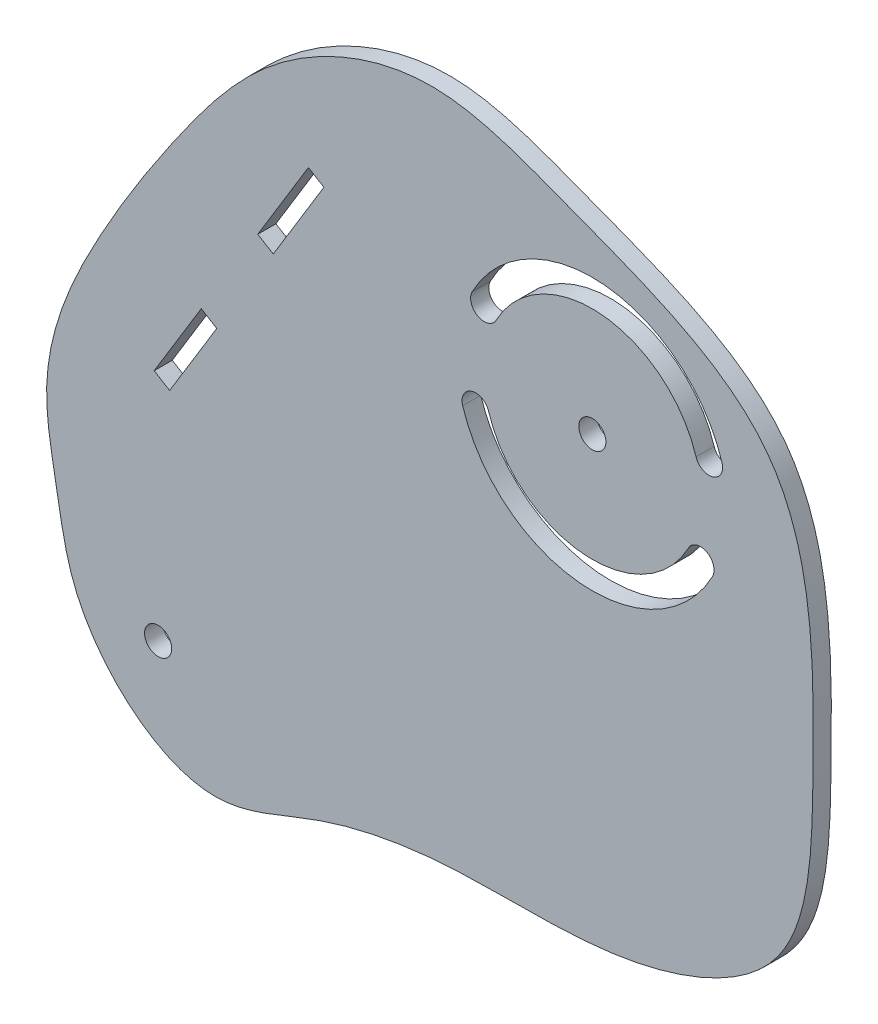
ISO-10303-21;
HEADER;
FILE_DESCRIPTION(('STEP AP214'),'2;1');
FILE_NAME('part.step','',(''),(''),'','','');
FILE_SCHEMA(('AUTOMOTIVE_DESIGN { 1 0 10303 214 1 1 1 1 }'));
ENDSEC;
DATA;
#1=APPLICATION_CONTEXT('core data for automotive mechanical design processes');
#2=APPLICATION_PROTOCOL_DEFINITION('international standard','automotive_design',2000,#1);
#3=PRODUCT_CONTEXT('',#1,'mechanical');
#4=PRODUCT('Part','Part','',(#3));
#5=PRODUCT_RELATED_PRODUCT_CATEGORY('part','',(#4));
#6=PRODUCT_DEFINITION_FORMATION('','',#4);
#7=PRODUCT_DEFINITION_CONTEXT('part definition',#1,'design');
#8=PRODUCT_DEFINITION('design','',#6,#7);
#9=PRODUCT_DEFINITION_SHAPE('','',#8);
#10=(LENGTH_UNIT() NAMED_UNIT(*) SI_UNIT(.MILLI.,.METRE.));
#11=(NAMED_UNIT(*) PLANE_ANGLE_UNIT() SI_UNIT($,.RADIAN.));
#12=(NAMED_UNIT(*) SI_UNIT($,.STERADIAN.) SOLID_ANGLE_UNIT());
#13=UNCERTAINTY_MEASURE_WITH_UNIT(LENGTH_MEASURE(1.E-05),#10,'distance_accuracy_value','');
#14=(GEOMETRIC_REPRESENTATION_CONTEXT(3) GLOBAL_UNCERTAINTY_ASSIGNED_CONTEXT((#13)) GLOBAL_UNIT_ASSIGNED_CONTEXT((#10,
#11,#12)) REPRESENTATION_CONTEXT('',''));
#15=CARTESIAN_POINT('',(0.,0.,0.));
#16=DIRECTION('',(0.,0.,1.));
#17=DIRECTION('',(1.,0.,0.));
#18=AXIS2_PLACEMENT_3D('',#15,#16,#17);
#19=CARTESIAN_POINT('',(479.935588645273,204.404353237434,3.175));
#20=DIRECTION('',(0.,0.,-1.));
#21=DIRECTION('',(-1.,0.,0.));
#22=AXIS2_PLACEMENT_3D('',#19,#20,#21);
#23=PLANE('',#22);
#24=DIRECTION('',(0.853905089894839,-0.520428763090287,0.));
#25=VECTOR('',#24,1.);
#26=CARTESIAN_POINT('',(460.279725499389,298.733085942485,3.17499999999998));
#27=LINE('',#26,#25);
#28=CARTESIAN_POINT('',(460.279725499389,298.733085942485,3.17499999999998));
#29=VERTEX_POINT('',#28);
#30=CARTESIAN_POINT('',(462.990874159805,297.080724619674,3.17499999999998));
#31=VERTEX_POINT('',#30);
#32=EDGE_CURVE('E333',#29,#31,#27,.T.);
#33=ORIENTED_EDGE('',*,*,#32,.T.);
#34=DIRECTION('',(-0.520428763090287,-0.853905089894839,0.));
#35=VECTOR('',#34,1.);
#36=CARTESIAN_POINT('',(472.905042096675,313.34761658217,3.17499999999998));
#37=LINE('',#36,#35);
#38=CARTESIAN_POINT('',(454.107011468107,282.504328946763,3.17499999999998));
#39=VERTEX_POINT('',#38);
#40=EDGE_CURVE('E328',#31,#39,#37,.T.);
#41=ORIENTED_EDGE('',*,*,#40,.T.);
#42=DIRECTION('',(0.853905089894839,-0.520428763090287,0.));
#43=VECTOR('',#42,1.);
#44=CARTESIAN_POINT('',(451.395862807691,284.156690269575,3.17499999999998));
#45=LINE('',#44,#43);
#46=CARTESIAN_POINT('',(451.395862807691,284.156690269575,3.175));
#47=VERTEX_POINT('',#46);
#48=EDGE_CURVE('E222',#47,#39,#45,.T.);
#49=ORIENTED_EDGE('',*,*,#48,.F.);
#50=DIRECTION('',(0.520428763090287,0.853905089894839,0.));
#51=VECTOR('',#50,1.);
#52=CARTESIAN_POINT('',(423.305720319893,238.067163042501,3.17499999999998));
#53=LINE('',#52,#51);
#54=EDGE_CURVE('E121',#47,#29,#53,.T.);
#55=ORIENTED_EDGE('',*,*,#54,.T.);
#56=EDGE_LOOP('',(#33,#41,#49,#55));
#57=FACE_BOUND('',#56,.T.);
#58=CARTESIAN_POINT('',(510.069921300712,283.128571475869,3.175));
#59=DIRECTION('',(0.,0.,1.));
#60=DIRECTION('',(1.,0.,0.));
#61=AXIS2_PLACEMENT_3D('',#58,#59,#60);
#62=CIRCLE('',#61,2.38124999999996);
#63=CARTESIAN_POINT('',(512.451171300712,283.128571475869,3.175));
#64=VERTEX_POINT('',#63);
#65=EDGE_CURVE('E281',#64,#64,#62,.T.);
#66=ORIENTED_EDGE('',*,*,#65,.F.);
#67=EDGE_LOOP('',(#66));
#68=FACE_BOUND('',#67,.T.);
#69=CARTESIAN_POINT('',(489.600011476688,276.781818892159,3.175));
#70=DIRECTION('',(0.,0.,1.));
#71=DIRECTION('',(1.,0.,0.));
#72=AXIS2_PLACEMENT_3D('',#69,#70,#71);
#73=CIRCLE('',#72,2.38125000000003);
#74=CARTESIAN_POINT('',(491.87444590158,277.487013623682,3.175));
#75=VERTEX_POINT('',#74);
#76=CARTESIAN_POINT('',(487.325577051797,276.076624160636,3.175));
#77=VERTEX_POINT('',#76);
#78=EDGE_CURVE('E271',#75,#77,#73,.T.);
#79=ORIENTED_EDGE('',*,*,#78,.F.);
#80=CARTESIAN_POINT('',(510.069921300712,283.128571475869,3.175));
#81=DIRECTION('',(0.,0.,1.));
#82=DIRECTION('',(1.,0.,0.));
#83=AXIS2_PLACEMENT_3D('',#80,#81,#82);
#84=CIRCLE('',#83,19.05);
#85=CARTESIAN_POINT('',(526.925249156089,274.251611247968,3.175));
#86=VERTEX_POINT('',#85);
#87=EDGE_CURVE('E267',#75,#86,#84,.T.);
#88=ORIENTED_EDGE('',*,*,#87,.T.);
#89=CARTESIAN_POINT('',(529.032165138011,273.14199121948,3.175));
#90=DIRECTION('',(0.,0.,1.));
#91=DIRECTION('',(1.,0.,0.));
#92=AXIS2_PLACEMENT_3D('',#89,#90,#91);
#93=CIRCLE('',#92,2.38124999999999);
#94=CARTESIAN_POINT('',(531.139081119934,272.032371190992,3.175));
#95=VERTEX_POINT('',#94);
#96=EDGE_CURVE('E284',#95,#86,#93,.T.);
#97=ORIENTED_EDGE('',*,*,#96,.F.);
#98=CARTESIAN_POINT('',(510.069921300712,283.128571475869,3.175));
#99=DIRECTION('',(0.,0.,1.));
#100=DIRECTION('',(1.,0.,0.));
#101=AXIS2_PLACEMENT_3D('',#98,#99,#100);
#102=CIRCLE('',#101,23.8125);
#103=EDGE_CURVE('E287',#77,#95,#102,.T.);
#104=ORIENTED_EDGE('',*,*,#103,.F.);
#105=EDGE_LOOP('',(#79,#88,#97,#104));
#106=FACE_BOUND('',#105,.T.);
#107=CARTESIAN_POINT('',(482.231401623898,321.886715929711,3.175));
#108=CARTESIAN_POINT('',(472.658750450767,322.009460208144,3.175));
#109=CARTESIAN_POINT('',(453.861225956515,314.203680080502,3.175));
#110=CARTESIAN_POINT('',(437.29118500421,292.379949665801,3.175));
#111=CARTESIAN_POINT('',(422.657620839133,269.573592211248,3.175));
#112=CARTESIAN_POINT('',(412.271626808425,246.791013666682,3.175));
#113=CARTESIAN_POINT('',(416.370028940273,227.389892698217,3.175));
#114=CARTESIAN_POINT('',(419.047324783607,208.369640308026,3.175));
#115=CARTESIAN_POINT('',(439.658548570835,189.984116417256,3.175));
#116=CARTESIAN_POINT('',(462.453949218385,201.690246769731,3.175));
#117=CARTESIAN_POINT('',(486.932445725519,206.242479606965,3.175));
#118=CARTESIAN_POINT('',(514.868653348573,203.588097311386,3.175));
#119=CARTESIAN_POINT('',(548.237919327791,217.112293196736,3.175));
#120=CARTESIAN_POINT('',(548.954385958087,255.942162895896,3.175));
#121=CARTESIAN_POINT('',(548.972060182787,300.023132225037,3.175));
#122=CARTESIAN_POINT('',(510.176288854937,313.731416791692,3.175));
#123=CARTESIAN_POINT('',(490.166726890058,321.784966084626,3.175));
#124=CARTESIAN_POINT('',(482.231401623898,321.886715929711,3.175));
#125=B_SPLINE_CURVE_WITH_KNOTS('',3,(#107,#108,#109,#110,#111,#112,#113,#114,#115,#116,#117,
#118,#119,#120,#121,#122,#123,#124),.UNSPECIFIED.,.T.,.F.,(4,1,1,1,1,1,1,1,1,1,1,1,1,1,1,4),(0.,
0.0706404080442197,0.131940245918746,0.1962560148141,0.269224583556331,0.301554992454619,
0.336790287157585,0.409868242401143,0.45212738014798,0.509949934193599,0.589114115509305,
0.6574305378213,0.735994241922473,0.845777607880984,0.941442072355199,1.),.UNSPECIFIED.);
#126=CARTESIAN_POINT('',(482.231401623898,321.886715929711,3.175));
#127=VERTEX_POINT('',#126);
#128=EDGE_CURVE('E234',#127,#127,#125,.T.);
#129=ORIENTED_EDGE('',*,*,#128,.T.);
#130=EDGE_LOOP('',(#129));
#131=FACE_BOUND('',#130,.T.);
#132=CARTESIAN_POINT('',(433.915403323879,213.637909991931,3.175));
#133=DIRECTION('',(0.,0.,1.));
#134=DIRECTION('',(1.,0.,0.));
#135=AXIS2_PLACEMENT_3D('',#132,#133,#134);
#136=CIRCLE('',#135,2.38125);
#137=CARTESIAN_POINT('',(436.296653323879,213.637909991931,3.175));
#138=VERTEX_POINT('',#137);
#139=EDGE_CURVE('E240',#138,#138,#136,.T.);
#140=ORIENTED_EDGE('',*,*,#139,.F.);
#141=EDGE_LOOP('',(#140));
#142=FACE_BOUND('',#141,.T.);
#143=CARTESIAN_POINT('',(530.539831124736,289.47532405958,3.175));
#144=DIRECTION('',(0.,0.,1.));
#145=DIRECTION('',(1.,0.,0.));
#146=AXIS2_PLACEMENT_3D('',#143,#144,#145);
#147=CIRCLE('',#146,2.38125000000007);
#148=CARTESIAN_POINT('',(528.265396699844,288.770129328056,3.175));
#149=VERTEX_POINT('',#148);
#150=CARTESIAN_POINT('',(532.814265549628,290.180518791103,3.175));
#151=VERTEX_POINT('',#150);
#152=EDGE_CURVE('E309',#149,#151,#147,.T.);
#153=ORIENTED_EDGE('',*,*,#152,.F.);
#154=CARTESIAN_POINT('',(510.069921300712,283.128571475869,3.175));
#155=DIRECTION('',(0.,0.,1.));
#156=DIRECTION('',(1.,0.,0.));
#157=AXIS2_PLACEMENT_3D('',#154,#155,#156);
#158=CIRCLE('',#157,19.0499999999999);
#159=CARTESIAN_POINT('',(493.214593445335,292.005531703771,3.175));
#160=VERTEX_POINT('',#159);
#161=EDGE_CURVE('E305',#149,#160,#158,.T.);
#162=ORIENTED_EDGE('',*,*,#161,.T.);
#163=CARTESIAN_POINT('',(491.107677463413,293.115151732259,3.175));
#164=DIRECTION('',(0.,0.,1.));
#165=DIRECTION('',(1.,0.,0.));
#166=AXIS2_PLACEMENT_3D('',#163,#164,#165);
#167=CIRCLE('',#166,2.38125000000002);
#168=CARTESIAN_POINT('',(489.000761481491,294.224771760746,3.175));
#169=VERTEX_POINT('',#168);
#170=EDGE_CURVE('E322',#169,#160,#167,.T.);
#171=ORIENTED_EDGE('',*,*,#170,.F.);
#172=CARTESIAN_POINT('',(510.069921300712,283.128571475869,3.175));
#173=DIRECTION('',(0.,0.,1.));
#174=DIRECTION('',(1.,0.,0.));
#175=AXIS2_PLACEMENT_3D('',#172,#173,#174);
#176=CIRCLE('',#175,23.8125);
#177=EDGE_CURVE('E325',#151,#169,#176,.T.);
#178=ORIENTED_EDGE('',*,*,#177,.F.);
#179=EDGE_LOOP('',(#153,#162,#171,#178));
#180=FACE_BOUND('',#179,.T.);
#181=DIRECTION('',(0.853905089894839,-0.520428763090287,0.));
#182=VECTOR('',#181,1.);
#183=CARTESIAN_POINT('',(433.219888256763,254.334055004998,3.17499999999998));
#184=LINE('',#183,#182);
#185=CARTESIAN_POINT('',(433.219888256763,254.334055004998,3.17499999999998));
#186=VERTEX_POINT('',#185);
#187=CARTESIAN_POINT('',(435.931036917179,252.681693682186,3.17499999999998));
#188=VERTEX_POINT('',#187);
#189=EDGE_CURVE('E341',#186,#188,#184,.T.);
#190=ORIENTED_EDGE('',*,*,#189,.F.);
#191=CARTESIAN_POINT('',(441.481694870821,267.889798307078,3.17499999999998));
#192=VERTEX_POINT('',#191);
#193=EDGE_CURVE('E319',#186,#192,#53,.T.);
#194=ORIENTED_EDGE('',*,*,#193,.T.);
#195=DIRECTION('',(0.853905089894839,-0.520428763090287,0.));
#196=VECTOR('',#195,1.);
#197=CARTESIAN_POINT('',(441.481694870821,267.889798307078,3.17499999999998));
#198=LINE('',#197,#196);
#199=CARTESIAN_POINT('',(444.192843531237,266.237436984267,3.175));
#200=VERTEX_POINT('',#199);
#201=EDGE_CURVE('E354',#192,#200,#198,.T.);
#202=ORIENTED_EDGE('',*,*,#201,.T.);
#203=EDGE_CURVE('E113',#200,#188,#37,.T.);
#204=ORIENTED_EDGE('',*,*,#203,.T.);
#205=EDGE_LOOP('',(#190,#194,#202,#204));
#206=FACE_BOUND('',#205,.T.);
#207=ADVANCED_FACE('F95',(#57,#68,#106,#131,#142,#180,#206),#23,.F.);
#208=CARTESIAN_POINT('',(479.935588645273,204.404353237434,0.));
#209=DIRECTION('',(0.,0.,-1.));
#210=DIRECTION('',(-1.,0.,0.));
#211=AXIS2_PLACEMENT_3D('',#208,#209,#210);
#212=PLANE('',#211);
#213=DIRECTION('',(0.853905089894839,-0.520428763090287,0.));
#214=VECTOR('',#213,1.);
#215=CARTESIAN_POINT('',(433.219888256763,254.334055004998,0.));
#216=LINE('',#215,#214);
#217=CARTESIAN_POINT('',(433.219888256763,254.334055004998,0.));
#218=VERTEX_POINT('',#217);
#219=CARTESIAN_POINT('',(435.931036917179,252.681693682186,0.));
#220=VERTEX_POINT('',#219);
#221=EDGE_CURVE('E343',#218,#220,#216,.T.);
#222=ORIENTED_EDGE('',*,*,#221,.T.);
#223=DIRECTION('',(0.520428763090288,0.853905089894839,0.));
#224=VECTOR('',#223,1.);
#225=CARTESIAN_POINT('',(426.395203878018,237.035563133644,0.));
#226=LINE('',#225,#224);
#227=CARTESIAN_POINT('',(444.192843531237,266.237436984267,0.));
#228=VERTEX_POINT('',#227);
#229=EDGE_CURVE('E105',#220,#228,#226,.T.);
#230=ORIENTED_EDGE('',*,*,#229,.T.);
#231=DIRECTION('',(0.853905089894839,-0.520428763090287,0.));
#232=VECTOR('',#231,1.);
#233=CARTESIAN_POINT('',(441.481694870821,267.889798307078,0.));
#234=LINE('',#233,#232);
#235=CARTESIAN_POINT('',(441.481694870821,267.889798307078,0.));
#236=VERTEX_POINT('',#235);
#237=EDGE_CURVE('E351',#236,#228,#234,.T.);
#238=ORIENTED_EDGE('',*,*,#237,.F.);
#239=DIRECTION('',(-0.520428763090287,-0.853905089894839,0.));
#240=VECTOR('',#239,1.);
#241=CARTESIAN_POINT('',(423.684055217602,238.687924456456,0.));
#242=LINE('',#241,#240);
#243=EDGE_CURVE('E12',#236,#218,#242,.T.);
#244=ORIENTED_EDGE('',*,*,#243,.T.);
#245=EDGE_LOOP('',(#222,#230,#238,#244));
#246=FACE_BOUND('',#245,.T.);
#247=DIRECTION('',(0.853905089894839,-0.520428763090287,0.));
#248=VECTOR('',#247,1.);
#249=CARTESIAN_POINT('',(451.395862807691,284.156690269575,0.));
#250=LINE('',#249,#248);
#251=CARTESIAN_POINT('',(451.395862807691,284.156690269575,0.));
#252=VERTEX_POINT('',#251);
#253=CARTESIAN_POINT('',(454.107011468107,282.504328946763,0.));
#254=VERTEX_POINT('',#253);
#255=EDGE_CURVE('E212',#252,#254,#250,.T.);
#256=ORIENTED_EDGE('',*,*,#255,.T.);
#257=CARTESIAN_POINT('',(462.990874159805,297.080724619674,0.));
#258=VERTEX_POINT('',#257);
#259=EDGE_CURVE('E100',#254,#258,#226,.T.);
#260=ORIENTED_EDGE('',*,*,#259,.T.);
#261=DIRECTION('',(0.853905089894839,-0.520428763090287,0.));
#262=VECTOR('',#261,1.);
#263=CARTESIAN_POINT('',(460.279725499389,298.733085942485,0.));
#264=LINE('',#263,#262);
#265=CARTESIAN_POINT('',(460.279725499389,298.733085942485,0.));
#266=VERTEX_POINT('',#265);
#267=EDGE_CURVE('E232',#266,#258,#264,.T.);
#268=ORIENTED_EDGE('',*,*,#267,.F.);
#269=EDGE_CURVE('E106',#266,#252,#242,.T.);
#270=ORIENTED_EDGE('',*,*,#269,.T.);
#271=EDGE_LOOP('',(#256,#260,#268,#270));
#272=FACE_BOUND('',#271,.T.);
#273=CARTESIAN_POINT('',(510.069921300712,283.128571475869,0.));
#274=DIRECTION('',(0.,0.,1.));
#275=DIRECTION('',(1.,0.,0.));
#276=AXIS2_PLACEMENT_3D('',#273,#274,#275);
#277=CIRCLE('',#276,19.05);
#278=CARTESIAN_POINT('',(491.87444590158,277.487013623682,0.));
#279=VERTEX_POINT('',#278);
#280=CARTESIAN_POINT('',(526.925249156089,274.251611247968,0.));
#281=VERTEX_POINT('',#280);
#282=EDGE_CURVE('E268',#279,#281,#277,.T.);
#283=ORIENTED_EDGE('',*,*,#282,.F.);
#284=CARTESIAN_POINT('',(489.600011476688,276.781818892159,0.));
#285=DIRECTION('',(0.,0.,1.));
#286=DIRECTION('',(1.,0.,0.));
#287=AXIS2_PLACEMENT_3D('',#284,#285,#286);
#288=CIRCLE('',#287,2.38125000000003);
#289=CARTESIAN_POINT('',(487.325577051797,276.076624160636,0.));
#290=VERTEX_POINT('',#289);
#291=EDGE_CURVE('E278',#279,#290,#288,.T.);
#292=ORIENTED_EDGE('',*,*,#291,.T.);
#293=CARTESIAN_POINT('',(510.069921300712,283.128571475869,0.));
#294=DIRECTION('',(0.,0.,1.));
#295=DIRECTION('',(1.,0.,0.));
#296=AXIS2_PLACEMENT_3D('',#293,#294,#295);
#297=CIRCLE('',#296,23.8125);
#298=CARTESIAN_POINT('',(531.139081119934,272.032371190992,0.));
#299=VERTEX_POINT('',#298);
#300=EDGE_CURVE('E275',#290,#299,#297,.T.);
#301=ORIENTED_EDGE('',*,*,#300,.T.);
#302=CARTESIAN_POINT('',(529.032165138011,273.14199121948,0.));
#303=DIRECTION('',(0.,0.,1.));
#304=DIRECTION('',(1.,0.,0.));
#305=AXIS2_PLACEMENT_3D('',#302,#303,#304);
#306=CIRCLE('',#305,2.38124999999999);
#307=EDGE_CURVE('E272',#299,#281,#306,.T.);
#308=ORIENTED_EDGE('',*,*,#307,.T.);
#309=EDGE_LOOP('',(#283,#292,#301,#308));
#310=FACE_BOUND('',#309,.T.);
#311=CARTESIAN_POINT('',(433.915403323879,213.637909991931,0.));
#312=DIRECTION('',(0.,0.,1.));
#313=DIRECTION('',(1.,0.,0.));
#314=AXIS2_PLACEMENT_3D('',#311,#312,#313);
#315=CIRCLE('',#314,2.38125);
#316=CARTESIAN_POINT('',(436.296653323879,213.637909991931,0.));
#317=VERTEX_POINT('',#316);
#318=EDGE_CURVE('E249',#317,#317,#315,.T.);
#319=ORIENTED_EDGE('',*,*,#318,.T.);
#320=EDGE_LOOP('',(#319));
#321=FACE_BOUND('',#320,.T.);
#322=CARTESIAN_POINT('',(482.231401623898,321.886715929711,0.));
#323=CARTESIAN_POINT('',(472.658750450767,322.009460208144,0.));
#324=CARTESIAN_POINT('',(453.861225956515,314.203680080502,0.));
#325=CARTESIAN_POINT('',(437.29118500421,292.379949665801,0.));
#326=CARTESIAN_POINT('',(422.657620839133,269.573592211248,0.));
#327=CARTESIAN_POINT('',(412.271626808425,246.791013666682,0.));
#328=CARTESIAN_POINT('',(416.370028940273,227.389892698217,0.));
#329=CARTESIAN_POINT('',(419.047324783607,208.369640308026,0.));
#330=CARTESIAN_POINT('',(439.658548570835,189.984116417256,0.));
#331=CARTESIAN_POINT('',(462.453949218385,201.690246769731,0.));
#332=CARTESIAN_POINT('',(486.932445725519,206.242479606965,0.));
#333=CARTESIAN_POINT('',(514.868653348573,203.588097311386,0.));
#334=CARTESIAN_POINT('',(548.237919327791,217.112293196736,0.));
#335=CARTESIAN_POINT('',(548.954385958087,255.942162895896,0.));
#336=CARTESIAN_POINT('',(548.972060182787,300.023132225037,0.));
#337=CARTESIAN_POINT('',(510.176288854937,313.731416791692,0.));
#338=CARTESIAN_POINT('',(490.166726890058,321.784966084626,0.));
#339=CARTESIAN_POINT('',(482.231401623898,321.886715929711,0.));
#340=B_SPLINE_CURVE_WITH_KNOTS('',3,(#322,#323,#324,#325,#326,#327,#328,#329,#330,#331,#332,
#333,#334,#335,#336,#337,#338,#339),.UNSPECIFIED.,.T.,.F.,(4,1,1,1,1,1,1,1,1,1,1,1,1,1,1,4),(0.,
0.0706404080442197,0.131940245918746,0.1962560148141,0.269224583556331,0.301554992454619,
0.336790287157585,0.409868242401143,0.45212738014798,0.509949934193599,0.589114115509305,
0.6574305378213,0.735994241922473,0.845777607880984,0.941442072355199,1.),.UNSPECIFIED.);
#341=CARTESIAN_POINT('',(482.231401623898,321.886715929711,0.));
#342=VERTEX_POINT('',#341);
#343=EDGE_CURVE('E236',#342,#342,#340,.T.);
#344=ORIENTED_EDGE('',*,*,#343,.F.);
#345=EDGE_LOOP('',(#344));
#346=FACE_BOUND('',#345,.T.);
#347=CARTESIAN_POINT('',(510.069921300712,283.128571475869,0.));
#348=DIRECTION('',(0.,0.,1.));
#349=DIRECTION('',(1.,0.,0.));
#350=AXIS2_PLACEMENT_3D('',#347,#348,#349);
#351=CIRCLE('',#350,2.38124999999996);
#352=CARTESIAN_POINT('',(512.451171300712,283.128571475869,0.));
#353=VERTEX_POINT('',#352);
#354=EDGE_CURVE('E290',#353,#353,#351,.T.);
#355=ORIENTED_EDGE('',*,*,#354,.T.);
#356=EDGE_LOOP('',(#355));
#357=FACE_BOUND('',#356,.T.);
#358=CARTESIAN_POINT('',(510.069921300712,283.128571475869,0.));
#359=DIRECTION('',(0.,0.,1.));
#360=DIRECTION('',(1.,0.,0.));
#361=AXIS2_PLACEMENT_3D('',#358,#359,#360);
#362=CIRCLE('',#361,19.0499999999999);
#363=CARTESIAN_POINT('',(528.265396699844,288.770129328056,0.));
#364=VERTEX_POINT('',#363);
#365=CARTESIAN_POINT('',(493.214593445335,292.005531703771,0.));
#366=VERTEX_POINT('',#365);
#367=EDGE_CURVE('E306',#364,#366,#362,.T.);
#368=ORIENTED_EDGE('',*,*,#367,.F.);
#369=CARTESIAN_POINT('',(530.539831124736,289.47532405958,0.));
#370=DIRECTION('',(0.,0.,1.));
#371=DIRECTION('',(1.,0.,0.));
#372=AXIS2_PLACEMENT_3D('',#369,#370,#371);
#373=CIRCLE('',#372,2.38125000000007);
#374=CARTESIAN_POINT('',(532.814265549628,290.180518791103,0.));
#375=VERTEX_POINT('',#374);
#376=EDGE_CURVE('E316',#364,#375,#373,.T.);
#377=ORIENTED_EDGE('',*,*,#376,.T.);
#378=CARTESIAN_POINT('',(510.069921300712,283.128571475869,0.));
#379=DIRECTION('',(0.,0.,1.));
#380=DIRECTION('',(1.,0.,0.));
#381=AXIS2_PLACEMENT_3D('',#378,#379,#380);
#382=CIRCLE('',#381,23.8125);
#383=CARTESIAN_POINT('',(489.000761481491,294.224771760746,0.));
#384=VERTEX_POINT('',#383);
#385=EDGE_CURVE('E313',#375,#384,#382,.T.);
#386=ORIENTED_EDGE('',*,*,#385,.T.);
#387=CARTESIAN_POINT('',(491.107677463413,293.115151732259,0.));
#388=DIRECTION('',(0.,0.,1.));
#389=DIRECTION('',(1.,0.,0.));
#390=AXIS2_PLACEMENT_3D('',#387,#388,#389);
#391=CIRCLE('',#390,2.38125000000002);
#392=EDGE_CURVE('E310',#384,#366,#391,.T.);
#393=ORIENTED_EDGE('',*,*,#392,.T.);
#394=EDGE_LOOP('',(#368,#377,#386,#393));
#395=FACE_BOUND('',#394,.T.);
#396=ADVANCED_FACE('F230',(#246,#272,#310,#321,#346,#357,#395),#212,.T.);
#397=DIRECTION('',(0.,0.,-1.));
#398=VECTOR('',#397,1.);
#399=SURFACE_OF_LINEAR_EXTRUSION('',#125,#398);
#400=ORIENTED_EDGE('',*,*,#128,.F.);
#401=EDGE_LOOP('',(#400));
#402=FACE_BOUND('',#401,.T.);
#403=ORIENTED_EDGE('',*,*,#343,.T.);
#404=EDGE_LOOP('',(#403));
#405=FACE_BOUND('',#404,.T.);
#406=ADVANCED_FACE('F97',(#402,#405),#399,.F.);
#407=CARTESIAN_POINT('',(433.915403323879,213.637909991931,3.175));
#408=DIRECTION('',(0.,0.,-1.));
#409=DIRECTION('',(-1.,0.,0.));
#410=AXIS2_PLACEMENT_3D('',#407,#408,#409);
#411=CYLINDRICAL_SURFACE('',#410,2.38125);
#412=ORIENTED_EDGE('',*,*,#139,.T.);
#413=EDGE_LOOP('',(#412));
#414=FACE_BOUND('',#413,.T.);
#415=ORIENTED_EDGE('',*,*,#318,.F.);
#416=EDGE_LOOP('',(#415));
#417=FACE_BOUND('',#416,.T.);
#418=ADVANCED_FACE('F385',(#414,#417),#411,.F.);
#419=CARTESIAN_POINT('',(489.600011476688,276.781818892159,3.175));
#420=DIRECTION('',(0.,0.,-1.));
#421=DIRECTION('',(-1.,0.,0.));
#422=AXIS2_PLACEMENT_3D('',#419,#420,#421);
#423=CYLINDRICAL_SURFACE('',#422,2.38125000000003);
#424=ORIENTED_EDGE('',*,*,#291,.F.);
#425=DIRECTION('',(0.,0.,-1.));
#426=VECTOR('',#425,1.);
#427=CARTESIAN_POINT('',(491.87444590158,277.487013623682,3.175));
#428=LINE('',#427,#426);
#429=EDGE_CURVE('E264',#75,#279,#428,.T.);
#430=ORIENTED_EDGE('',*,*,#429,.F.);
#431=ORIENTED_EDGE('',*,*,#78,.T.);
#432=DIRECTION('',(0.,0.,-1.));
#433=VECTOR('',#432,1.);
#434=CARTESIAN_POINT('',(487.325577051797,276.076624160636,3.175));
#435=LINE('',#434,#433);
#436=EDGE_CURVE('E255',#77,#290,#435,.T.);
#437=ORIENTED_EDGE('',*,*,#436,.T.);
#438=EDGE_LOOP('',(#424,#430,#431,#437));
#439=FACE_BOUND('',#438,.T.);
#440=ADVANCED_FACE('F388',(#439),#423,.F.);
#441=CARTESIAN_POINT('',(510.069921300712,283.128571475869,3.175));
#442=DIRECTION('',(0.,0.,-1.));
#443=DIRECTION('',(-1.,0.,0.));
#444=AXIS2_PLACEMENT_3D('',#441,#442,#443);
#445=CYLINDRICAL_SURFACE('',#444,23.8125);
#446=ORIENTED_EDGE('',*,*,#300,.F.);
#447=ORIENTED_EDGE('',*,*,#436,.F.);
#448=ORIENTED_EDGE('',*,*,#103,.T.);
#449=DIRECTION('',(0.,0.,-1.));
#450=VECTOR('',#449,1.);
#451=CARTESIAN_POINT('',(531.139081119934,272.032371190992,3.175));
#452=LINE('',#451,#450);
#453=EDGE_CURVE('E260',#95,#299,#452,.T.);
#454=ORIENTED_EDGE('',*,*,#453,.T.);
#455=EDGE_LOOP('',(#446,#447,#448,#454));
#456=FACE_BOUND('',#455,.T.);
#457=ADVANCED_FACE('F392',(#456),#445,.F.);
#458=CARTESIAN_POINT('',(529.032165138011,273.14199121948,3.175));
#459=DIRECTION('',(0.,0.,-1.));
#460=DIRECTION('',(-1.,0.,0.));
#461=AXIS2_PLACEMENT_3D('',#458,#459,#460);
#462=CYLINDRICAL_SURFACE('',#461,2.38124999999999);
#463=ORIENTED_EDGE('',*,*,#307,.F.);
#464=ORIENTED_EDGE('',*,*,#453,.F.);
#465=ORIENTED_EDGE('',*,*,#96,.T.);
#466=DIRECTION('',(0.,0.,-1.));
#467=VECTOR('',#466,1.);
#468=CARTESIAN_POINT('',(526.925249156089,274.251611247968,3.175));
#469=LINE('',#468,#467);
#470=EDGE_CURVE('E262',#86,#281,#469,.T.);
#471=ORIENTED_EDGE('',*,*,#470,.T.);
#472=EDGE_LOOP('',(#463,#464,#465,#471));
#473=FACE_BOUND('',#472,.T.);
#474=ADVANCED_FACE('F396',(#473),#462,.F.);
#475=CARTESIAN_POINT('',(510.069921300712,283.128571475869,3.175));
#476=DIRECTION('',(0.,0.,-1.));
#477=DIRECTION('',(-1.,0.,0.));
#478=AXIS2_PLACEMENT_3D('',#475,#476,#477);
#479=CYLINDRICAL_SURFACE('',#478,19.05);
#480=ORIENTED_EDGE('',*,*,#282,.T.);
#481=ORIENTED_EDGE('',*,*,#470,.F.);
#482=ORIENTED_EDGE('',*,*,#87,.F.);
#483=ORIENTED_EDGE('',*,*,#429,.T.);
#484=EDGE_LOOP('',(#480,#481,#482,#483));
#485=FACE_BOUND('',#484,.T.);
#486=ADVANCED_FACE('F400',(#485),#479,.T.);
#487=CARTESIAN_POINT('',(510.069921300712,283.128571475869,3.175));
#488=DIRECTION('',(0.,0.,-1.));
#489=DIRECTION('',(-1.,0.,0.));
#490=AXIS2_PLACEMENT_3D('',#487,#488,#489);
#491=CYLINDRICAL_SURFACE('',#490,2.38124999999996);
#492=ORIENTED_EDGE('',*,*,#65,.T.);
#493=EDGE_LOOP('',(#492));
#494=FACE_BOUND('',#493,.T.);
#495=ORIENTED_EDGE('',*,*,#354,.F.);
#496=EDGE_LOOP('',(#495));
#497=FACE_BOUND('',#496,.T.);
#498=ADVANCED_FACE('F404',(#494,#497),#491,.F.);
#499=CARTESIAN_POINT('',(530.539831124736,289.47532405958,3.175));
#500=DIRECTION('',(0.,0.,-1.));
#501=DIRECTION('',(-1.,0.,0.));
#502=AXIS2_PLACEMENT_3D('',#499,#500,#501);
#503=CYLINDRICAL_SURFACE('',#502,2.38125000000007);
#504=ORIENTED_EDGE('',*,*,#376,.F.);
#505=DIRECTION('',(0.,0.,-1.));
#506=VECTOR('',#505,1.);
#507=CARTESIAN_POINT('',(528.265396699844,288.770129328056,3.175));
#508=LINE('',#507,#506);
#509=EDGE_CURVE('E302',#149,#364,#508,.T.);
#510=ORIENTED_EDGE('',*,*,#509,.F.);
#511=ORIENTED_EDGE('',*,*,#152,.T.);
#512=DIRECTION('',(0.,0.,-1.));
#513=VECTOR('',#512,1.);
#514=CARTESIAN_POINT('',(532.814265549628,290.180518791103,3.175));
#515=LINE('',#514,#513);
#516=EDGE_CURVE('E293',#151,#375,#515,.T.);
#517=ORIENTED_EDGE('',*,*,#516,.T.);
#518=EDGE_LOOP('',(#504,#510,#511,#517));
#519=FACE_BOUND('',#518,.T.);
#520=ADVANCED_FACE('F408',(#519),#503,.F.);
#521=CARTESIAN_POINT('',(510.069921300712,283.128571475869,3.175));
#522=DIRECTION('',(0.,0.,-1.));
#523=DIRECTION('',(-1.,0.,0.));
#524=AXIS2_PLACEMENT_3D('',#521,#522,#523);
#525=CYLINDRICAL_SURFACE('',#524,23.8125);
#526=ORIENTED_EDGE('',*,*,#385,.F.);
#527=ORIENTED_EDGE('',*,*,#516,.F.);
#528=ORIENTED_EDGE('',*,*,#177,.T.);
#529=DIRECTION('',(0.,0.,-1.));
#530=VECTOR('',#529,1.);
#531=CARTESIAN_POINT('',(489.000761481491,294.224771760746,3.175));
#532=LINE('',#531,#530);
#533=EDGE_CURVE('E298',#169,#384,#532,.T.);
#534=ORIENTED_EDGE('',*,*,#533,.T.);
#535=EDGE_LOOP('',(#526,#527,#528,#534));
#536=FACE_BOUND('',#535,.T.);
#537=ADVANCED_FACE('F412',(#536),#525,.F.);
#538=CARTESIAN_POINT('',(491.107677463413,293.115151732259,3.175));
#539=DIRECTION('',(0.,0.,-1.));
#540=DIRECTION('',(-1.,0.,0.));
#541=AXIS2_PLACEMENT_3D('',#538,#539,#540);
#542=CYLINDRICAL_SURFACE('',#541,2.38125000000002);
#543=ORIENTED_EDGE('',*,*,#392,.F.);
#544=ORIENTED_EDGE('',*,*,#533,.F.);
#545=ORIENTED_EDGE('',*,*,#170,.T.);
#546=DIRECTION('',(0.,0.,-1.));
#547=VECTOR('',#546,1.);
#548=CARTESIAN_POINT('',(493.214593445335,292.005531703771,3.175));
#549=LINE('',#548,#547);
#550=EDGE_CURVE('E300',#160,#366,#549,.T.);
#551=ORIENTED_EDGE('',*,*,#550,.T.);
#552=EDGE_LOOP('',(#543,#544,#545,#551));
#553=FACE_BOUND('',#552,.T.);
#554=ADVANCED_FACE('F416',(#553),#542,.F.);
#555=CARTESIAN_POINT('',(510.069921300712,283.128571475869,3.175));
#556=DIRECTION('',(0.,0.,-1.));
#557=DIRECTION('',(-1.,0.,0.));
#558=AXIS2_PLACEMENT_3D('',#555,#556,#557);
#559=CYLINDRICAL_SURFACE('',#558,19.0499999999999);
#560=ORIENTED_EDGE('',*,*,#367,.T.);
#561=ORIENTED_EDGE('',*,*,#550,.F.);
#562=ORIENTED_EDGE('',*,*,#161,.F.);
#563=ORIENTED_EDGE('',*,*,#509,.T.);
#564=EDGE_LOOP('',(#560,#561,#562,#563));
#565=FACE_BOUND('',#564,.T.);
#566=ADVANCED_FACE('F420',(#565),#559,.T.);
#567=CARTESIAN_POINT('',(451.395862807691,284.156690269575,0.));
#568=DIRECTION('',(0.520428763090287,0.853905089894839,0.));
#569=DIRECTION('',(-0.853905089894839,0.520428763090287,0.));
#570=AXIS2_PLACEMENT_3D('',#567,#568,#569);
#571=PLANE('',#570);
#572=DIRECTION('',(0.,0.,1.));
#573=VECTOR('',#572,1.);
#574=CARTESIAN_POINT('',(454.107011468107,282.504328946763,0.));
#575=LINE('',#574,#573);
#576=EDGE_CURVE('E217',#254,#39,#575,.T.);
#577=ORIENTED_EDGE('',*,*,#576,.F.);
#578=ORIENTED_EDGE('',*,*,#255,.F.);
#579=DIRECTION('',(0.,0.,1.));
#580=VECTOR('',#579,1.);
#581=CARTESIAN_POINT('',(451.395862807691,284.156690269575,0.));
#582=LINE('',#581,#580);
#583=EDGE_CURVE('E215',#252,#47,#582,.T.);
#584=ORIENTED_EDGE('',*,*,#583,.T.);
#585=ORIENTED_EDGE('',*,*,#48,.T.);
#586=EDGE_LOOP('',(#577,#578,#584,#585));
#587=FACE_BOUND('',#586,.T.);
#588=ADVANCED_FACE('F213',(#587),#571,.T.);
#589=CARTESIAN_POINT('',(460.279725499389,298.733085942485,3.17499999999998));
#590=DIRECTION('',(-0.520428763090287,-0.853905089894839,0.));
#591=DIRECTION('',(0.853905089894839,-0.520428763090287,0.));
#592=AXIS2_PLACEMENT_3D('',#589,#590,#591);
#593=PLANE('',#592);
#594=DIRECTION('',(0.,0.,-1.));
#595=VECTOR('',#594,1.);
#596=CARTESIAN_POINT('',(462.990874159805,297.080724619674,3.17499999999998));
#597=LINE('',#596,#595);
#598=EDGE_CURVE('E338',#31,#258,#597,.T.);
#599=ORIENTED_EDGE('',*,*,#598,.F.);
#600=ORIENTED_EDGE('',*,*,#32,.F.);
#601=DIRECTION('',(0.,0.,-1.));
#602=VECTOR('',#601,1.);
#603=CARTESIAN_POINT('',(460.279725499389,298.733085942485,3.17499999999998));
#604=LINE('',#603,#602);
#605=EDGE_CURVE('E336',#29,#266,#604,.T.);
#606=ORIENTED_EDGE('',*,*,#605,.T.);
#607=ORIENTED_EDGE('',*,*,#267,.T.);
#608=EDGE_LOOP('',(#599,#600,#606,#607));
#609=FACE_BOUND('',#608,.T.);
#610=ADVANCED_FACE('F431',(#609),#593,.T.);
#611=CARTESIAN_POINT('',(423.305720319893,238.067163042501,-121.503588909927));
#612=DIRECTION('',(0.853905089894839,-0.520428763090287,0.));
#613=DIRECTION('',(0.520428763090287,0.853905089894839,0.));
#614=AXIS2_PLACEMENT_3D('',#611,#612,#613);
#615=PLANE('',#614);
#616=ORIENTED_EDGE('',*,*,#605,.F.);
#617=ORIENTED_EDGE('',*,*,#54,.F.);
#618=ORIENTED_EDGE('',*,*,#583,.F.);
#619=ORIENTED_EDGE('',*,*,#269,.F.);
#620=EDGE_LOOP('',(#616,#617,#618,#619));
#621=FACE_BOUND('',#620,.T.);
#622=ADVANCED_FACE('F225',(#621),#615,.T.);
#623=CARTESIAN_POINT('',(472.905042096675,313.34761658217,-121.503588909927));
#624=DIRECTION('',(-0.853905089894839,0.520428763090288,0.));
#625=DIRECTION('',(-0.520428763090288,-0.853905089894839,0.));
#626=AXIS2_PLACEMENT_3D('',#623,#624,#625);
#627=PLANE('',#626);
#628=ORIENTED_EDGE('',*,*,#576,.T.);
#629=ORIENTED_EDGE('',*,*,#40,.F.);
#630=ORIENTED_EDGE('',*,*,#598,.T.);
#631=ORIENTED_EDGE('',*,*,#259,.F.);
#632=EDGE_LOOP('',(#628,#629,#630,#631));
#633=FACE_BOUND('',#632,.T.);
#634=ADVANCED_FACE('F425',(#633),#627,.T.);
#635=DIRECTION('',(0.,0.,1.));
#636=VECTOR('',#635,1.);
#637=CARTESIAN_POINT('',(435.931036917179,252.681693682186,3.17499999999998));
#638=LINE('',#637,#636);
#639=EDGE_CURVE('E349',#220,#188,#638,.T.);
#640=ORIENTED_EDGE('',*,*,#639,.T.);
#641=ORIENTED_EDGE('',*,*,#203,.F.);
#642=DIRECTION('',(0.,0.,-1.));
#643=VECTOR('',#642,1.);
#644=CARTESIAN_POINT('',(444.192843531237,266.237436984267,0.));
#645=LINE('',#644,#643);
#646=EDGE_CURVE('E227',#200,#228,#645,.T.);
#647=ORIENTED_EDGE('',*,*,#646,.T.);
#648=ORIENTED_EDGE('',*,*,#229,.F.);
#649=EDGE_LOOP('',(#640,#641,#647,#648));
#650=FACE_BOUND('',#649,.T.);
#651=ADVANCED_FACE('F371',(#650),#627,.T.);
#652=DIRECTION('',(0.,0.,-1.));
#653=VECTOR('',#652,1.);
#654=CARTESIAN_POINT('',(441.481694870821,267.889798307078,0.));
#655=LINE('',#654,#653);
#656=EDGE_CURVE('E223',#192,#236,#655,.T.);
#657=ORIENTED_EDGE('',*,*,#656,.F.);
#658=ORIENTED_EDGE('',*,*,#193,.F.);
#659=DIRECTION('',(0.,0.,1.));
#660=VECTOR('',#659,1.);
#661=CARTESIAN_POINT('',(433.219888256763,254.334055004998,3.17499999999998));
#662=LINE('',#661,#660);
#663=EDGE_CURVE('E346',#218,#186,#662,.T.);
#664=ORIENTED_EDGE('',*,*,#663,.F.);
#665=ORIENTED_EDGE('',*,*,#243,.F.);
#666=EDGE_LOOP('',(#657,#658,#664,#665));
#667=FACE_BOUND('',#666,.T.);
#668=ADVANCED_FACE('F368',(#667),#615,.T.);
#669=CARTESIAN_POINT('',(433.219888256763,254.334055004998,3.17499999999998));
#670=DIRECTION('',(0.520428763090287,0.853905089894839,0.));
#671=DIRECTION('',(-0.853905089894839,0.520428763090287,0.));
#672=AXIS2_PLACEMENT_3D('',#669,#670,#671);
#673=PLANE('',#672);
#674=ORIENTED_EDGE('',*,*,#639,.F.);
#675=ORIENTED_EDGE('',*,*,#221,.F.);
#676=ORIENTED_EDGE('',*,*,#663,.T.);
#677=ORIENTED_EDGE('',*,*,#189,.T.);
#678=EDGE_LOOP('',(#674,#675,#676,#677));
#679=FACE_BOUND('',#678,.T.);
#680=ADVANCED_FACE('F373',(#679),#673,.T.);
#681=CARTESIAN_POINT('',(441.481694870821,267.889798307078,0.));
#682=DIRECTION('',(-0.520428763090287,-0.853905089894839,0.));
#683=DIRECTION('',(0.853905089894839,-0.520428763090287,0.));
#684=AXIS2_PLACEMENT_3D('',#681,#682,#683);
#685=PLANE('',#684);
#686=ORIENTED_EDGE('',*,*,#646,.F.);
#687=ORIENTED_EDGE('',*,*,#201,.F.);
#688=ORIENTED_EDGE('',*,*,#656,.T.);
#689=ORIENTED_EDGE('',*,*,#237,.T.);
#690=EDGE_LOOP('',(#686,#687,#688,#689));
#691=FACE_BOUND('',#690,.T.);
#692=ADVANCED_FACE('F363',(#691),#685,.T.);
#693=CLOSED_SHELL('',(#207,#396,#406,#418,#440,#457,#474,#486,#498,#520,#537,#554,#566,#588,
#610,#622,#634,#651,#668,#680,#692));
#694=MANIFOLD_SOLID_BREP('B2',#693);
#695=ADVANCED_BREP_SHAPE_REPRESENTATION('',(#18,#694),#14);
#696=SHAPE_DEFINITION_REPRESENTATION(#9,#695);
ENDSEC;
END-ISO-10303-21;
